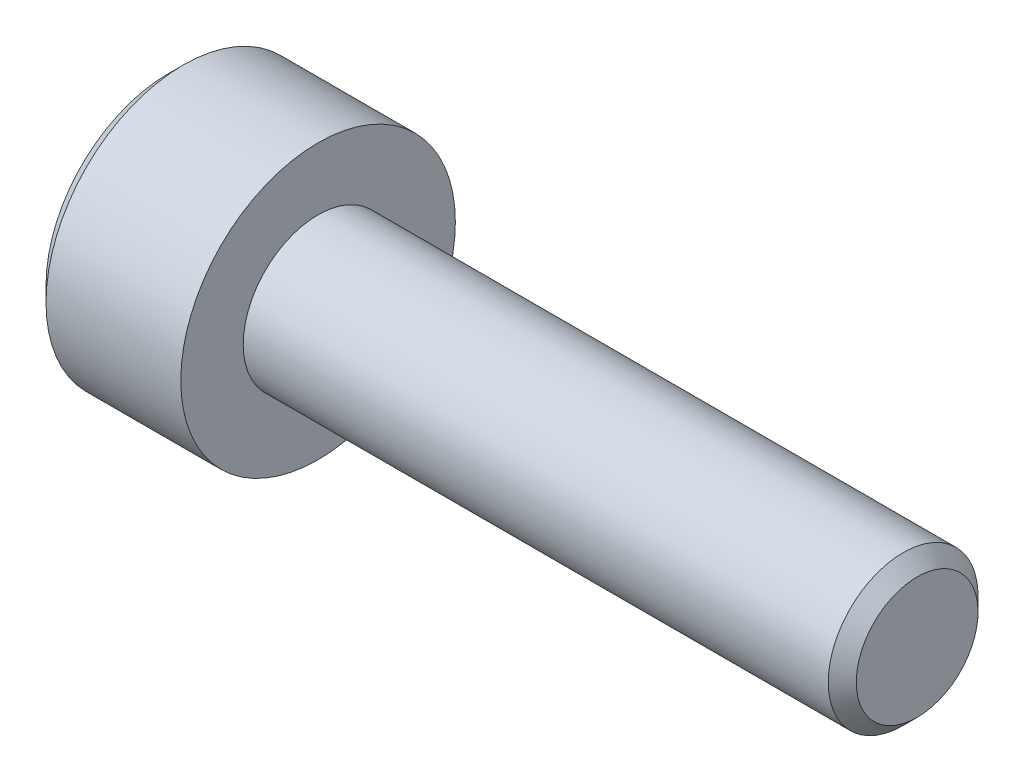
ISO-10303-21;
HEADER;
FILE_DESCRIPTION(('STEP AP214'),'2;1');
FILE_NAME('part.step','',(''),(''),'','','');
FILE_SCHEMA(('AUTOMOTIVE_DESIGN { 1 0 10303 214 1 1 1 1 }'));
ENDSEC;
DATA;
#1=APPLICATION_CONTEXT('core data for automotive mechanical design processes');
#2=APPLICATION_PROTOCOL_DEFINITION('international standard','automotive_design',2000,#1);
#3=PRODUCT_CONTEXT('',#1,'mechanical');
#4=PRODUCT('Part','Part','',(#3));
#5=PRODUCT_RELATED_PRODUCT_CATEGORY('part','',(#4));
#6=PRODUCT_DEFINITION_FORMATION('','',#4);
#7=PRODUCT_DEFINITION_CONTEXT('part definition',#1,'design');
#8=PRODUCT_DEFINITION('design','',#6,#7);
#9=PRODUCT_DEFINITION_SHAPE('','',#8);
#10=(LENGTH_UNIT() NAMED_UNIT(*) SI_UNIT(.MILLI.,.METRE.));
#11=(NAMED_UNIT(*) PLANE_ANGLE_UNIT() SI_UNIT($,.RADIAN.));
#12=(NAMED_UNIT(*) SI_UNIT($,.STERADIAN.) SOLID_ANGLE_UNIT());
#13=UNCERTAINTY_MEASURE_WITH_UNIT(LENGTH_MEASURE(1.E-05),#10,'distance_accuracy_value','');
#14=(GEOMETRIC_REPRESENTATION_CONTEXT(3) GLOBAL_UNCERTAINTY_ASSIGNED_CONTEXT((#13)) GLOBAL_UNIT_ASSIGNED_CONTEXT((#10,
#11,#12)) REPRESENTATION_CONTEXT('',''));
#15=CARTESIAN_POINT('',(0.,0.,0.));
#16=DIRECTION('',(0.,0.,1.));
#17=DIRECTION('',(1.,0.,0.));
#18=AXIS2_PLACEMENT_3D('',#15,#16,#17);
#19=CARTESIAN_POINT('',(1.30000000018526,0.,0.));
#20=DIRECTION('',(-1.,0.,0.));
#21=DIRECTION('',(0.,0.,1.));
#22=AXIS2_PLACEMENT_3D('',#19,#20,#21);
#23=CONICAL_SURFACE('',#22,1.27999999978101,1.04719755099051);
#24=CARTESIAN_POINT('',(1.30000000005399,0.,0.));
#25=DIRECTION('',(-1.,0.,0.));
#26=DIRECTION('',(0.,0.,1.));
#27=AXIS2_PLACEMENT_3D('',#24,#25,#26);
#28=CIRCLE('',#27,1.28000000000839);
#29=CARTESIAN_POINT('',(1.30000000002699,1.10851251684771,-0.640000000002097));
#30=VERTEX_POINT('',#29);
#31=CARTESIAN_POINT('',(1.30000000002699,0.,-1.28000000000419));
#32=VERTEX_POINT('',#31);
#33=EDGE_CURVE('E107',#30,#32,#28,.T.);
#34=ORIENTED_EDGE('',*,*,#33,.T.);
#35=CARTESIAN_POINT('',(1.30000000005399,0.,0.));
#36=DIRECTION('',(-1.,0.,0.));
#37=DIRECTION('',(0.,0.,1.));
#38=AXIS2_PLACEMENT_3D('',#35,#36,#37);
#39=CIRCLE('',#38,1.28000000000839);
#40=CARTESIAN_POINT('',(1.30000000002699,-1.10851251684772,-0.640000000002099));
#41=VERTEX_POINT('',#40);
#42=EDGE_CURVE('E108',#32,#41,#39,.T.);
#43=ORIENTED_EDGE('',*,*,#42,.T.);
#44=CARTESIAN_POINT('',(1.30000000005399,0.,0.));
#45=DIRECTION('',(-1.,0.,0.));
#46=DIRECTION('',(0.,0.,1.));
#47=AXIS2_PLACEMENT_3D('',#44,#45,#46);
#48=CIRCLE('',#47,1.28000000000839);
#49=CARTESIAN_POINT('',(1.30000000002699,-1.10851251684771,0.640000000002097));
#50=VERTEX_POINT('',#49);
#51=EDGE_CURVE('E218',#41,#50,#48,.T.);
#52=ORIENTED_EDGE('',*,*,#51,.T.);
#53=CARTESIAN_POINT('',(1.30000000005399,0.,0.));
#54=DIRECTION('',(-1.,0.,0.));
#55=DIRECTION('',(0.,0.,1.));
#56=AXIS2_PLACEMENT_3D('',#53,#54,#55);
#57=CIRCLE('',#56,1.28000000000839);
#58=CARTESIAN_POINT('',(1.30000000002699,0.,1.28000000000419));
#59=VERTEX_POINT('',#58);
#60=EDGE_CURVE('E89',#50,#59,#57,.T.);
#61=ORIENTED_EDGE('',*,*,#60,.T.);
#62=CARTESIAN_POINT('',(1.30000000005399,0.,0.));
#63=DIRECTION('',(-1.,0.,0.));
#64=DIRECTION('',(0.,0.,1.));
#65=AXIS2_PLACEMENT_3D('',#62,#63,#64);
#66=CIRCLE('',#65,1.28000000000839);
#67=CARTESIAN_POINT('',(1.30000000002699,1.10851251684771,0.640000000002096));
#68=VERTEX_POINT('',#67);
#69=EDGE_CURVE('E20',#59,#68,#66,.T.);
#70=ORIENTED_EDGE('',*,*,#69,.T.);
#71=CARTESIAN_POINT('',(1.30000000005399,0.,0.));
#72=DIRECTION('',(-1.,0.,0.));
#73=DIRECTION('',(0.,0.,1.));
#74=AXIS2_PLACEMENT_3D('',#71,#72,#73);
#75=CIRCLE('',#74,1.28000000000839);
#76=EDGE_CURVE('E94',#68,#30,#75,.T.);
#77=ORIENTED_EDGE('',*,*,#76,.T.);
#78=EDGE_LOOP('',(#34,#43,#52,#61,#70,#77));
#79=FACE_BOUND('',#78,.T.);
#80=CARTESIAN_POINT('',(2.03900834480919,0.,2.8421709430404E-10));
#81=VERTEX_POINT('',#80);
#82=VERTEX_LOOP('',#81);
#83=FACE_BOUND('',#82,.T.);
#84=ADVANCED_FACE('F17',(#79,#83),#23,.F.);
#85=CARTESIAN_POINT('',(1.3,1.47801668912544,0.));
#86=DIRECTION('',(1.,0.,0.));
#87=DIRECTION('',(0.,0.,-1.));
#88=AXIS2_PLACEMENT_3D('',#85,#86,#87);
#89=PLANE('',#88);
#90=DIRECTION('',(0.,0.5,-0.866025403784439));
#91=VECTOR('',#90,1.);
#92=CARTESIAN_POINT('',(1.3,1.47801668912544,0.));
#93=LINE('',#92,#91);
#94=CARTESIAN_POINT('',(1.3,0.739008344562718,1.28));
#95=VERTEX_POINT('',#94);
#96=EDGE_CURVE('E111',#68,#95,#93,.F.);
#97=ORIENTED_EDGE('',*,*,#96,.F.);
#98=ORIENTED_EDGE('',*,*,#69,.F.);
#99=DIRECTION('',(0.,-1.,0.));
#100=VECTOR('',#99,1.);
#101=CARTESIAN_POINT('',(1.3,-0.739008344562723,1.28));
#102=LINE('',#101,#100);
#103=EDGE_CURVE('E113',#59,#95,#102,.F.);
#104=ORIENTED_EDGE('',*,*,#103,.T.);
#105=EDGE_LOOP('',(#97,#98,#104));
#106=FACE_BOUND('',#105,.T.);
#107=ADVANCED_FACE('F112',(#106),#89,.F.);
#108=CARTESIAN_POINT('',(1.3,1.47801668912544,0.));
#109=DIRECTION('',(1.,0.,0.));
#110=DIRECTION('',(0.,0.,-1.));
#111=AXIS2_PLACEMENT_3D('',#108,#109,#110);
#112=PLANE('',#111);
#113=DIRECTION('',(0.,-1.,0.));
#114=VECTOR('',#113,1.);
#115=CARTESIAN_POINT('',(1.3,-0.739008344562723,1.28));
#116=LINE('',#115,#114);
#117=CARTESIAN_POINT('',(1.3,-0.739008344562723,1.28));
#118=VERTEX_POINT('',#117);
#119=EDGE_CURVE('E116',#118,#59,#116,.F.);
#120=ORIENTED_EDGE('',*,*,#119,.T.);
#121=ORIENTED_EDGE('',*,*,#60,.F.);
#122=DIRECTION('',(0.,0.5,0.866025403784438));
#123=VECTOR('',#122,1.);
#124=CARTESIAN_POINT('',(1.3,-0.739008344562723,1.28));
#125=LINE('',#124,#123);
#126=EDGE_CURVE('E168',#118,#50,#125,.F.);
#127=ORIENTED_EDGE('',*,*,#126,.F.);
#128=EDGE_LOOP('',(#120,#121,#127));
#129=FACE_BOUND('',#128,.T.);
#130=ADVANCED_FACE('F227',(#129),#112,.F.);
#131=CARTESIAN_POINT('',(1.3,1.47801668912544,0.));
#132=DIRECTION('',(1.,0.,0.));
#133=DIRECTION('',(0.,0.,-1.));
#134=AXIS2_PLACEMENT_3D('',#131,#132,#133);
#135=PLANE('',#134);
#136=DIRECTION('',(0.,0.5,0.866025403784438));
#137=VECTOR('',#136,1.);
#138=CARTESIAN_POINT('',(1.3,-0.739008344562723,1.28));
#139=LINE('',#138,#137);
#140=CARTESIAN_POINT('',(1.3,-1.47801668912545,0.));
#141=VERTEX_POINT('',#140);
#142=EDGE_CURVE('E164',#50,#141,#139,.F.);
#143=ORIENTED_EDGE('',*,*,#142,.F.);
#144=ORIENTED_EDGE('',*,*,#51,.F.);
#145=DIRECTION('',(0.,-0.5,0.866025403784439));
#146=VECTOR('',#145,1.);
#147=CARTESIAN_POINT('',(1.3,-1.47801668912545,0.));
#148=LINE('',#147,#146);
#149=EDGE_CURVE('E151',#141,#41,#148,.F.);
#150=ORIENTED_EDGE('',*,*,#149,.F.);
#151=EDGE_LOOP('',(#143,#144,#150));
#152=FACE_BOUND('',#151,.T.);
#153=ADVANCED_FACE('F228',(#152),#135,.F.);
#154=CARTESIAN_POINT('',(1.3,1.47801668912544,0.));
#155=DIRECTION('',(1.,0.,0.));
#156=DIRECTION('',(0.,0.,-1.));
#157=AXIS2_PLACEMENT_3D('',#154,#155,#156);
#158=PLANE('',#157);
#159=DIRECTION('',(0.,-0.5,0.866025403784439));
#160=VECTOR('',#159,1.);
#161=CARTESIAN_POINT('',(1.3,-1.47801668912545,0.));
#162=LINE('',#161,#160);
#163=CARTESIAN_POINT('',(1.3,-0.739008344562727,-1.28));
#164=VERTEX_POINT('',#163);
#165=EDGE_CURVE('E148',#41,#164,#162,.F.);
#166=ORIENTED_EDGE('',*,*,#165,.F.);
#167=ORIENTED_EDGE('',*,*,#42,.F.);
#168=DIRECTION('',(0.,1.,0.));
#169=VECTOR('',#168,1.);
#170=CARTESIAN_POINT('',(1.3,0.739008344562717,-1.28));
#171=LINE('',#170,#169);
#172=EDGE_CURVE('E142',#32,#164,#171,.F.);
#173=ORIENTED_EDGE('',*,*,#172,.T.);
#174=EDGE_LOOP('',(#166,#167,#173));
#175=FACE_BOUND('',#174,.T.);
#176=ADVANCED_FACE('F266',(#175),#158,.F.);
#177=CARTESIAN_POINT('',(1.3,1.47801668912544,0.));
#178=DIRECTION('',(1.,0.,0.));
#179=DIRECTION('',(0.,0.,-1.));
#180=AXIS2_PLACEMENT_3D('',#177,#178,#179);
#181=PLANE('',#180);
#182=DIRECTION('',(0.,0.5,0.866025403784438));
#183=VECTOR('',#182,1.);
#184=CARTESIAN_POINT('',(1.3,1.47801668912544,0.));
#185=LINE('',#184,#183);
#186=CARTESIAN_POINT('',(1.3,1.47801668912544,0.));
#187=VERTEX_POINT('',#186);
#188=EDGE_CURVE('E105',#187,#30,#185,.F.);
#189=ORIENTED_EDGE('',*,*,#188,.T.);
#190=ORIENTED_EDGE('',*,*,#76,.F.);
#191=DIRECTION('',(0.,0.5,-0.866025403784439));
#192=VECTOR('',#191,1.);
#193=CARTESIAN_POINT('',(1.3,1.47801668912544,0.));
#194=LINE('',#193,#192);
#195=EDGE_CURVE('E102',#187,#68,#194,.F.);
#196=ORIENTED_EDGE('',*,*,#195,.F.);
#197=EDGE_LOOP('',(#189,#190,#196));
#198=FACE_BOUND('',#197,.T.);
#199=ADVANCED_FACE('F100',(#198),#181,.F.);
#200=CARTESIAN_POINT('',(1.3,1.47801668912544,0.));
#201=DIRECTION('',(1.,0.,0.));
#202=DIRECTION('',(0.,0.,-1.));
#203=AXIS2_PLACEMENT_3D('',#200,#201,#202);
#204=PLANE('',#203);
#205=DIRECTION('',(0.,1.,0.));
#206=VECTOR('',#205,1.);
#207=CARTESIAN_POINT('',(1.3,0.739008344562717,-1.28));
#208=LINE('',#207,#206);
#209=CARTESIAN_POINT('',(1.3,0.739008344562719,-1.28));
#210=VERTEX_POINT('',#209);
#211=EDGE_CURVE('E145',#210,#32,#208,.F.);
#212=ORIENTED_EDGE('',*,*,#211,.T.);
#213=ORIENTED_EDGE('',*,*,#33,.F.);
#214=DIRECTION('',(0.,0.5,0.866025403784438));
#215=VECTOR('',#214,1.);
#216=CARTESIAN_POINT('',(1.3,1.47801668912544,0.));
#217=LINE('',#216,#215);
#218=EDGE_CURVE('E250',#30,#210,#217,.F.);
#219=ORIENTED_EDGE('',*,*,#218,.T.);
#220=EDGE_LOOP('',(#212,#213,#219));
#221=FACE_BOUND('',#220,.T.);
#222=ADVANCED_FACE('F263',(#221),#204,.F.);
#223=CARTESIAN_POINT('',(1.3,1.47801668912544,0.));
#224=DIRECTION('',(0.,-0.866025403784439,-0.5));
#225=DIRECTION('',(0.,0.5,-0.866025403784439));
#226=AXIS2_PLACEMENT_3D('',#223,#224,#225);
#227=PLANE('',#226);
#228=ORIENTED_EDGE('',*,*,#96,.T.);
#229=DIRECTION('',(1.,0.,0.));
#230=VECTOR('',#229,1.);
#231=CARTESIAN_POINT('',(1.3,0.739008344562719,1.28));
#232=LINE('',#231,#230);
#233=CARTESIAN_POINT('',(0.,0.739008344562718,1.28));
#234=VERTEX_POINT('',#233);
#235=EDGE_CURVE('E188',#95,#234,#232,.F.);
#236=ORIENTED_EDGE('',*,*,#235,.T.);
#237=DIRECTION('',(0.,-0.499999999999999,0.866025403784439));
#238=VECTOR('',#237,1.);
#239=CARTESIAN_POINT('',(0.,1.47801668912544,0.));
#240=LINE('',#239,#238);
#241=CARTESIAN_POINT('',(0.,1.47801668912544,0.));
#242=VERTEX_POINT('',#241);
#243=EDGE_CURVE('E129',#242,#234,#240,.T.);
#244=ORIENTED_EDGE('',*,*,#243,.F.);
#245=DIRECTION('',(1.,0.,0.));
#246=VECTOR('',#245,1.);
#247=CARTESIAN_POINT('',(1.3,1.47801668912544,0.));
#248=LINE('',#247,#246);
#249=EDGE_CURVE('E120',#242,#187,#248,.T.);
#250=ORIENTED_EDGE('',*,*,#249,.T.);
#251=ORIENTED_EDGE('',*,*,#195,.T.);
#252=EDGE_LOOP('',(#228,#236,#244,#250,#251));
#253=FACE_BOUND('',#252,.T.);
#254=ADVANCED_FACE('F118',(#253),#227,.T.);
#255=CARTESIAN_POINT('',(1.3,-0.739008344562723,1.28));
#256=DIRECTION('',(0.,0.,1.));
#257=DIRECTION('',(0.,-1.,0.));
#258=AXIS2_PLACEMENT_3D('',#255,#256,#257);
#259=PLANE('',#258);
#260=ORIENTED_EDGE('',*,*,#235,.F.);
#261=ORIENTED_EDGE('',*,*,#103,.F.);
#262=ORIENTED_EDGE('',*,*,#119,.F.);
#263=DIRECTION('',(1.,0.,0.));
#264=VECTOR('',#263,1.);
#265=CARTESIAN_POINT('',(1.3,-0.739008344562723,1.28));
#266=LINE('',#265,#264);
#267=CARTESIAN_POINT('',(0.,-0.739008344562723,1.28));
#268=VERTEX_POINT('',#267);
#269=EDGE_CURVE('E183',#268,#118,#266,.T.);
#270=ORIENTED_EDGE('',*,*,#269,.F.);
#271=DIRECTION('',(0.,1.,0.));
#272=VECTOR('',#271,1.);
#273=CARTESIAN_POINT('',(0.,0.,1.28));
#274=LINE('',#273,#272);
#275=EDGE_CURVE('E132',#234,#268,#274,.F.);
#276=ORIENTED_EDGE('',*,*,#275,.F.);
#277=EDGE_LOOP('',(#260,#261,#262,#270,#276));
#278=FACE_BOUND('',#277,.T.);
#279=ADVANCED_FACE('F234',(#278),#259,.F.);
#280=CARTESIAN_POINT('',(1.3,-0.739008344562723,1.28));
#281=DIRECTION('',(0.,0.866025403784438,-0.5));
#282=DIRECTION('',(0.,0.5,0.866025403784438));
#283=AXIS2_PLACEMENT_3D('',#280,#281,#282);
#284=PLANE('',#283);
#285=ORIENTED_EDGE('',*,*,#142,.T.);
#286=DIRECTION('',(1.,0.,0.));
#287=VECTOR('',#286,1.);
#288=CARTESIAN_POINT('',(1.3,-1.47801668912545,0.));
#289=LINE('',#288,#287);
#290=CARTESIAN_POINT('',(0.,-1.47801668912545,0.));
#291=VERTEX_POINT('',#290);
#292=EDGE_CURVE('E159',#291,#141,#289,.T.);
#293=ORIENTED_EDGE('',*,*,#292,.F.);
#294=DIRECTION('',(0.,-0.500000000000003,-0.866025403784437));
#295=VECTOR('',#294,1.);
#296=CARTESIAN_POINT('',(0.,-0.739008344562723,1.28));
#297=LINE('',#296,#295);
#298=EDGE_CURVE('E174',#268,#291,#297,.T.);
#299=ORIENTED_EDGE('',*,*,#298,.F.);
#300=ORIENTED_EDGE('',*,*,#269,.T.);
#301=ORIENTED_EDGE('',*,*,#126,.T.);
#302=EDGE_LOOP('',(#285,#293,#299,#300,#301));
#303=FACE_BOUND('',#302,.T.);
#304=ADVANCED_FACE('F230',(#303),#284,.T.);
#305=CARTESIAN_POINT('',(1.3,-1.47801668912545,0.));
#306=DIRECTION('',(0.,0.866025403784439,0.5));
#307=DIRECTION('',(0.,-0.5,0.866025403784439));
#308=AXIS2_PLACEMENT_3D('',#305,#306,#307);
#309=PLANE('',#308);
#310=ORIENTED_EDGE('',*,*,#165,.T.);
#311=DIRECTION('',(1.,0.,0.));
#312=VECTOR('',#311,1.);
#313=CARTESIAN_POINT('',(1.3,-0.739008344562725,-1.28));
#314=LINE('',#313,#312);
#315=CARTESIAN_POINT('',(0.,-0.739008344562727,-1.28));
#316=VERTEX_POINT('',#315);
#317=EDGE_CURVE('E144',#164,#316,#314,.F.);
#318=ORIENTED_EDGE('',*,*,#317,.T.);
#319=DIRECTION('',(0.,0.500000000000002,-0.866025403784437));
#320=VECTOR('',#319,1.);
#321=CARTESIAN_POINT('',(0.,-1.47801668912545,0.));
#322=LINE('',#321,#320);
#323=EDGE_CURVE('E171',#291,#316,#322,.T.);
#324=ORIENTED_EDGE('',*,*,#323,.F.);
#325=ORIENTED_EDGE('',*,*,#292,.T.);
#326=ORIENTED_EDGE('',*,*,#149,.T.);
#327=EDGE_LOOP('',(#310,#318,#324,#325,#326));
#328=FACE_BOUND('',#327,.T.);
#329=ADVANCED_FACE('F269',(#328),#309,.T.);
#330=CARTESIAN_POINT('',(1.3,0.739008344562717,-1.28));
#331=DIRECTION('',(0.,0.,-1.));
#332=DIRECTION('',(0.,1.,0.));
#333=AXIS2_PLACEMENT_3D('',#330,#331,#332);
#334=PLANE('',#333);
#335=ORIENTED_EDGE('',*,*,#317,.F.);
#336=ORIENTED_EDGE('',*,*,#172,.F.);
#337=ORIENTED_EDGE('',*,*,#211,.F.);
#338=DIRECTION('',(1.,0.,0.));
#339=VECTOR('',#338,1.);
#340=CARTESIAN_POINT('',(1.3,0.73900834456272,-1.28));
#341=LINE('',#340,#339);
#342=CARTESIAN_POINT('',(0.,0.739008344562718,-1.28));
#343=VERTEX_POINT('',#342);
#344=EDGE_CURVE('E35',#210,#343,#341,.F.);
#345=ORIENTED_EDGE('',*,*,#344,.T.);
#346=DIRECTION('',(0.,1.,0.));
#347=VECTOR('',#346,1.);
#348=CARTESIAN_POINT('',(0.,0.,-1.28));
#349=LINE('',#348,#347);
#350=EDGE_CURVE('E139',#316,#343,#349,.T.);
#351=ORIENTED_EDGE('',*,*,#350,.F.);
#352=EDGE_LOOP('',(#335,#336,#337,#345,#351));
#353=FACE_BOUND('',#352,.T.);
#354=ADVANCED_FACE('F267',(#353),#334,.F.);
#355=CARTESIAN_POINT('',(1.3,1.47801668912544,0.));
#356=DIRECTION('',(0.,0.866025403784438,-0.5));
#357=DIRECTION('',(0.,0.5,0.866025403784438));
#358=AXIS2_PLACEMENT_3D('',#355,#356,#357);
#359=PLANE('',#358);
#360=ORIENTED_EDGE('',*,*,#344,.F.);
#361=ORIENTED_EDGE('',*,*,#218,.F.);
#362=ORIENTED_EDGE('',*,*,#188,.F.);
#363=ORIENTED_EDGE('',*,*,#249,.F.);
#364=DIRECTION('',(0.,0.500000000000002,0.866025403784437));
#365=VECTOR('',#364,1.);
#366=CARTESIAN_POINT('',(0.,0.739008344562717,-1.28));
#367=LINE('',#366,#365);
#368=EDGE_CURVE('E135',#343,#242,#367,.T.);
#369=ORIENTED_EDGE('',*,*,#368,.F.);
#370=EDGE_LOOP('',(#360,#361,#362,#363,#369));
#371=FACE_BOUND('',#370,.T.);
#372=ADVANCED_FACE('F237',(#371),#359,.F.);
#373=CARTESIAN_POINT('',(0.,0.,0.));
#374=DIRECTION('',(-1.,0.,0.));
#375=DIRECTION('',(0.,0.,1.));
#376=AXIS2_PLACEMENT_3D('',#373,#374,#375);
#377=PLANE('',#376);
#378=ORIENTED_EDGE('',*,*,#350,.T.);
#379=ORIENTED_EDGE('',*,*,#368,.T.);
#380=ORIENTED_EDGE('',*,*,#243,.T.);
#381=ORIENTED_EDGE('',*,*,#275,.T.);
#382=ORIENTED_EDGE('',*,*,#298,.T.);
#383=ORIENTED_EDGE('',*,*,#323,.T.);
#384=EDGE_LOOP('',(#378,#379,#380,#381,#382,#383));
#385=FACE_BOUND('',#384,.T.);
#386=CARTESIAN_POINT('',(0.,0.,0.));
#387=DIRECTION('',(1.,0.,0.));
#388=DIRECTION('',(0.,0.,-1.));
#389=AXIS2_PLACEMENT_3D('',#386,#387,#388);
#390=CIRCLE('',#389,2.45000000001028);
#391=CARTESIAN_POINT('',(0.,0.,-2.45000000001028));
#392=VERTEX_POINT('',#391);
#393=EDGE_CURVE('E138',#392,#392,#390,.T.);
#394=ORIENTED_EDGE('',*,*,#393,.F.);
#395=EDGE_LOOP('',(#394));
#396=FACE_BOUND('',#395,.T.);
#397=ADVANCED_FACE('F240',(#385,#396),#377,.T.);
#398=CARTESIAN_POINT('',(0.299999999981537,0.,0.));
#399=DIRECTION('',(1.,0.,0.));
#400=DIRECTION('',(0.,0.,-1.));
#401=AXIS2_PLACEMENT_3D('',#398,#399,#400);
#402=CONICAL_SURFACE('',#401,2.74999999999181,0.785398163397448);
#403=ORIENTED_EDGE('',*,*,#393,.T.);
#404=EDGE_LOOP('',(#403));
#405=FACE_BOUND('',#404,.T.);
#406=CARTESIAN_POINT('',(0.300000000000002,0.,0.));
#407=DIRECTION('',(-1.,0.,0.));
#408=DIRECTION('',(0.,0.,1.));
#409=AXIS2_PLACEMENT_3D('',#406,#407,#408);
#410=CIRCLE('',#409,2.75);
#411=CARTESIAN_POINT('',(0.300000000000002,0.,2.75));
#412=VERTEX_POINT('',#411);
#413=EDGE_CURVE('E214',#412,#412,#410,.F.);
#414=ORIENTED_EDGE('',*,*,#413,.F.);
#415=EDGE_LOOP('',(#414));
#416=FACE_BOUND('',#415,.T.);
#417=ADVANCED_FACE('F302',(#405,#416),#402,.T.);
#418=CARTESIAN_POINT('',(-31.75,0.,0.));
#419=DIRECTION('',(-1.,0.,0.));
#420=DIRECTION('',(0.,0.,1.));
#421=AXIS2_PLACEMENT_3D('',#418,#419,#420);
#422=CYLINDRICAL_SURFACE('',#421,2.75);
#423=CARTESIAN_POINT('',(3.,0.,0.));
#424=DIRECTION('',(-1.,0.,0.));
#425=DIRECTION('',(0.,0.,1.));
#426=AXIS2_PLACEMENT_3D('',#423,#424,#425);
#427=CIRCLE('',#426,2.75);
#428=CARTESIAN_POINT('',(3.,0.,2.75));
#429=VERTEX_POINT('',#428);
#430=EDGE_CURVE('E211',#429,#429,#427,.F.);
#431=ORIENTED_EDGE('',*,*,#430,.F.);
#432=EDGE_LOOP('',(#431));
#433=FACE_BOUND('',#432,.T.);
#434=ORIENTED_EDGE('',*,*,#413,.T.);
#435=EDGE_LOOP('',(#434));
#436=FACE_BOUND('',#435,.T.);
#437=ADVANCED_FACE('F298',(#433,#436),#422,.T.);
#438=CARTESIAN_POINT('',(15.,1.2195,0.));
#439=DIRECTION('',(1.,0.,0.));
#440=DIRECTION('',(0.,0.,-1.));
#441=AXIS2_PLACEMENT_3D('',#438,#439,#440);
#442=PLANE('',#441);
#443=CARTESIAN_POINT('',(14.9999999999864,0.,0.));
#444=DIRECTION('',(-1.,0.,0.));
#445=DIRECTION('',(0.,-1.,0.));
#446=AXIS2_PLACEMENT_3D('',#443,#444,#445);
#447=CIRCLE('',#446,1.21950000004745);
#448=CARTESIAN_POINT('',(14.9999999999864,-1.21950000004745,0.));
#449=VERTEX_POINT('',#448);
#450=EDGE_CURVE('E208',#449,#449,#447,.T.);
#451=ORIENTED_EDGE('',*,*,#450,.F.);
#452=EDGE_LOOP('',(#451));
#453=FACE_BOUND('',#452,.T.);
#454=ADVANCED_FACE('F294',(#453),#442,.T.);
#455=CARTESIAN_POINT('',(3.,2.75,0.));
#456=DIRECTION('',(1.,0.,0.));
#457=DIRECTION('',(0.,0.,-1.));
#458=AXIS2_PLACEMENT_3D('',#455,#456,#457);
#459=PLANE('',#458);
#460=CARTESIAN_POINT('',(3.,0.,0.));
#461=DIRECTION('',(-1.,0.,0.));
#462=DIRECTION('',(0.,0.,1.));
#463=AXIS2_PLACEMENT_3D('',#460,#461,#462);
#464=CIRCLE('',#463,1.49999999999999);
#465=CARTESIAN_POINT('',(3.,0.,1.49999999999999));
#466=VERTEX_POINT('',#465);
#467=EDGE_CURVE('E26',#466,#466,#464,.F.);
#468=ORIENTED_EDGE('',*,*,#467,.F.);
#469=EDGE_LOOP('',(#468));
#470=FACE_BOUND('',#469,.T.);
#471=ORIENTED_EDGE('',*,*,#430,.T.);
#472=EDGE_LOOP('',(#471));
#473=FACE_BOUND('',#472,.T.);
#474=ADVANCED_FACE('F287',(#470,#473),#459,.T.);
#475=CARTESIAN_POINT('',(14.7194999999556,0.,0.));
#476=DIRECTION('',(-1.,0.,0.));
#477=DIRECTION('',(0.,-1.,0.));
#478=AXIS2_PLACEMENT_3D('',#475,#476,#477);
#479=CONICAL_SURFACE('',#478,1.50000000002137,0.785398163296123);
#480=ORIENTED_EDGE('',*,*,#450,.T.);
#481=EDGE_LOOP('',(#480));
#482=FACE_BOUND('',#481,.T.);
#483=CARTESIAN_POINT('',(14.7195,0.,0.));
#484=DIRECTION('',(-1.,0.,0.));
#485=DIRECTION('',(0.,0.,1.));
#486=AXIS2_PLACEMENT_3D('',#483,#484,#485);
#487=CIRCLE('',#486,1.49999999999999);
#488=CARTESIAN_POINT('',(14.7195,0.,1.49999999999999));
#489=VERTEX_POINT('',#488);
#490=EDGE_CURVE('E11',#489,#489,#487,.T.);
#491=ORIENTED_EDGE('',*,*,#490,.F.);
#492=EDGE_LOOP('',(#491));
#493=FACE_BOUND('',#492,.T.);
#494=ADVANCED_FACE('F281',(#482,#493),#479,.T.);
#495=CARTESIAN_POINT('',(-31.75,0.,0.));
#496=DIRECTION('',(-1.,0.,0.));
#497=DIRECTION('',(0.,0.,1.));
#498=AXIS2_PLACEMENT_3D('',#495,#496,#497);
#499=CYLINDRICAL_SURFACE('',#498,1.49999999999999);
#500=ORIENTED_EDGE('',*,*,#490,.T.);
#501=EDGE_LOOP('',(#500));
#502=FACE_BOUND('',#501,.T.);
#503=ORIENTED_EDGE('',*,*,#467,.T.);
#504=EDGE_LOOP('',(#503));
#505=FACE_BOUND('',#504,.T.);
#506=ADVANCED_FACE('F279',(#502,#505),#499,.T.);
#507=CLOSED_SHELL('',(#84,#107,#130,#153,#176,#199,#222,#254,#279,#304,#329,#354,#372,#397,#417,
#437,#454,#474,#494,#506));
#508=MANIFOLD_SOLID_BREP('B1',#507);
#509=ADVANCED_BREP_SHAPE_REPRESENTATION('',(#18,#508),#14);
#510=SHAPE_DEFINITION_REPRESENTATION(#9,#509);
ENDSEC;
END-ISO-10303-21;
